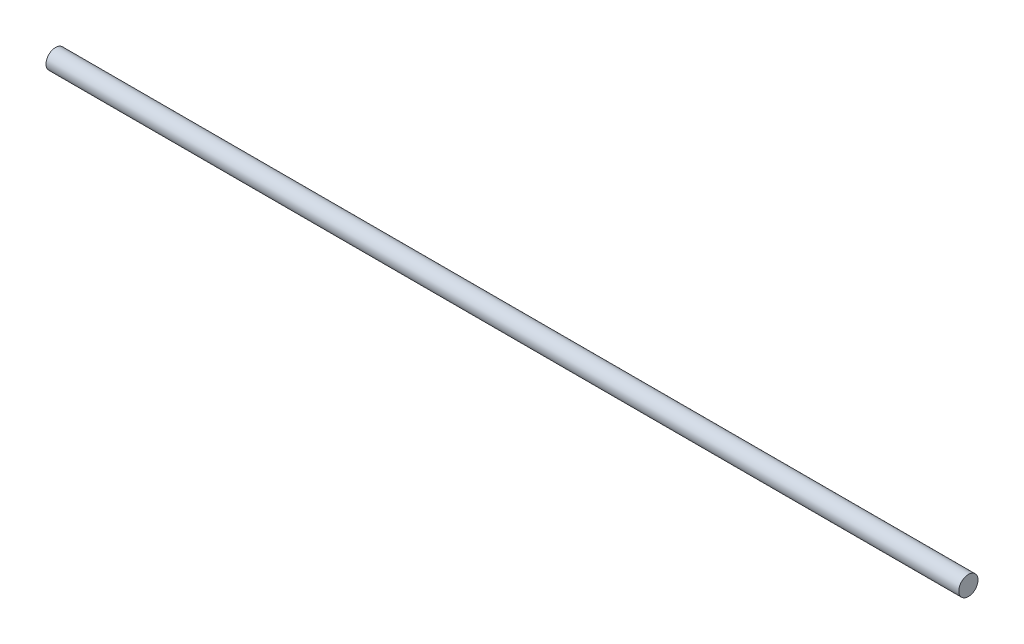
ISO-10303-21;
HEADER;
FILE_DESCRIPTION(('STEP AP214'),'2;1');
FILE_NAME('part.step','',(''),(''),'','','');
FILE_SCHEMA(('AUTOMOTIVE_DESIGN { 1 0 10303 214 1 1 1 1 }'));
ENDSEC;
DATA;
#1=APPLICATION_CONTEXT('core data for automotive mechanical design processes');
#2=APPLICATION_PROTOCOL_DEFINITION('international standard','automotive_design',2000,#1);
#3=PRODUCT_CONTEXT('',#1,'mechanical');
#4=PRODUCT('Part','Part','',(#3));
#5=PRODUCT_RELATED_PRODUCT_CATEGORY('part','',(#4));
#6=PRODUCT_DEFINITION_FORMATION('','',#4);
#7=PRODUCT_DEFINITION_CONTEXT('part definition',#1,'design');
#8=PRODUCT_DEFINITION('design','',#6,#7);
#9=PRODUCT_DEFINITION_SHAPE('','',#8);
#10=(LENGTH_UNIT() NAMED_UNIT(*) SI_UNIT(.MILLI.,.METRE.));
#11=(NAMED_UNIT(*) PLANE_ANGLE_UNIT() SI_UNIT($,.RADIAN.));
#12=(NAMED_UNIT(*) SI_UNIT($,.STERADIAN.) SOLID_ANGLE_UNIT());
#13=UNCERTAINTY_MEASURE_WITH_UNIT(LENGTH_MEASURE(1.E-05),#10,'distance_accuracy_value','');
#14=(GEOMETRIC_REPRESENTATION_CONTEXT(3) GLOBAL_UNCERTAINTY_ASSIGNED_CONTEXT((#13)) GLOBAL_UNIT_ASSIGNED_CONTEXT((#10,
#11,#12)) REPRESENTATION_CONTEXT('',''));
#15=CARTESIAN_POINT('',(0.,0.,0.));
#16=DIRECTION('',(0.,0.,1.));
#17=DIRECTION('',(1.,0.,0.));
#18=AXIS2_PLACEMENT_3D('',#15,#16,#17);
#19=CARTESIAN_POINT('',(0.,0.,0.));
#20=DIRECTION('',(1.,0.,0.));
#21=DIRECTION('',(0.,0.,-1.));
#22=AXIS2_PLACEMENT_3D('',#19,#20,#21);
#23=PLANE('',#22);
#24=CARTESIAN_POINT('',(0.,0.,0.));
#25=DIRECTION('',(1.,0.,0.));
#26=DIRECTION('',(0.,0.,-1.));
#27=AXIS2_PLACEMENT_3D('',#24,#25,#26);
#28=CIRCLE('',#27,13.7);
#29=CARTESIAN_POINT('',(0.,0.,-13.7));
#30=VERTEX_POINT('',#29);
#31=EDGE_CURVE('E42',#30,#30,#28,.T.);
#32=ORIENTED_EDGE('',*,*,#31,.T.);
#33=EDGE_LOOP('',(#32));
#34=FACE_BOUND('',#33,.T.);
#35=ADVANCED_FACE('F35',(#34),#23,.T.);
#36=CARTESIAN_POINT('',(-1300.,0.,0.));
#37=DIRECTION('',(1.,0.,0.));
#38=DIRECTION('',(0.,0.,-1.));
#39=AXIS2_PLACEMENT_3D('',#36,#37,#38);
#40=PLANE('',#39);
#41=CARTESIAN_POINT('',(-1300.,0.,0.));
#42=DIRECTION('',(1.,0.,0.));
#43=DIRECTION('',(0.,0.,-1.));
#44=AXIS2_PLACEMENT_3D('',#41,#42,#43);
#45=CIRCLE('',#44,13.7);
#46=CARTESIAN_POINT('',(-1300.,0.,-13.7));
#47=VERTEX_POINT('',#46);
#48=EDGE_CURVE('E11',#47,#47,#45,.T.);
#49=ORIENTED_EDGE('',*,*,#48,.F.);
#50=EDGE_LOOP('',(#49));
#51=FACE_BOUND('',#50,.T.);
#52=ADVANCED_FACE('F51',(#51),#40,.F.);
#53=CARTESIAN_POINT('',(0.,0.,0.));
#54=DIRECTION('',(-1.,0.,0.));
#55=DIRECTION('',(0.,0.,1.));
#56=AXIS2_PLACEMENT_3D('',#53,#54,#55);
#57=CYLINDRICAL_SURFACE('',#56,13.7);
#58=ORIENTED_EDGE('',*,*,#48,.T.);
#59=EDGE_LOOP('',(#58));
#60=FACE_BOUND('',#59,.T.);
#61=ORIENTED_EDGE('',*,*,#31,.F.);
#62=EDGE_LOOP('',(#61));
#63=FACE_BOUND('',#62,.T.);
#64=ADVANCED_FACE('F49',(#60,#63),#57,.T.);
#65=CLOSED_SHELL('',(#35,#52,#64));
#66=MANIFOLD_SOLID_BREP('B2',#65);
#67=ADVANCED_BREP_SHAPE_REPRESENTATION('',(#18,#66),#14);
#68=SHAPE_DEFINITION_REPRESENTATION(#9,#67);
ENDSEC;
END-ISO-10303-21;
